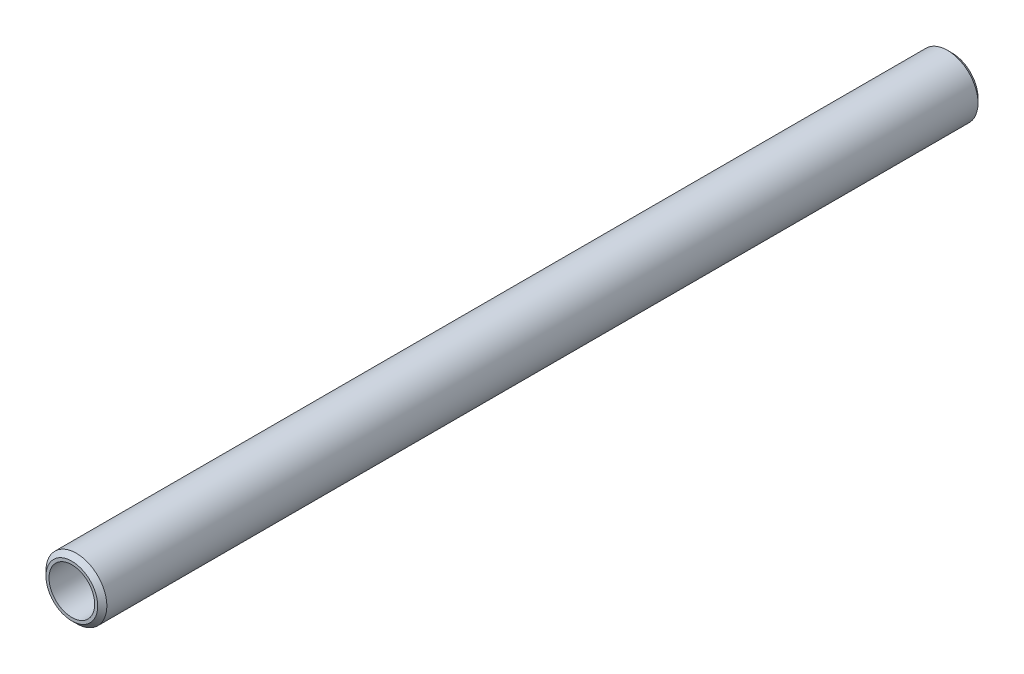
ISO-10303-21;
HEADER;
FILE_DESCRIPTION(('STEP AP214'),'2;1');
FILE_NAME('part.step','',(''),(''),'','','');
FILE_SCHEMA(('AUTOMOTIVE_DESIGN { 1 0 10303 214 1 1 1 1 }'));
ENDSEC;
DATA;
#1=APPLICATION_CONTEXT('core data for automotive mechanical design processes');
#2=APPLICATION_PROTOCOL_DEFINITION('international standard','automotive_design',2000,#1);
#3=PRODUCT_CONTEXT('',#1,'mechanical');
#4=PRODUCT('Part','Part','',(#3));
#5=PRODUCT_RELATED_PRODUCT_CATEGORY('part','',(#4));
#6=PRODUCT_DEFINITION_FORMATION('','',#4);
#7=PRODUCT_DEFINITION_CONTEXT('part definition',#1,'design');
#8=PRODUCT_DEFINITION('design','',#6,#7);
#9=PRODUCT_DEFINITION_SHAPE('','',#8);
#10=(LENGTH_UNIT() NAMED_UNIT(*) SI_UNIT(.MILLI.,.METRE.));
#11=(NAMED_UNIT(*) PLANE_ANGLE_UNIT() SI_UNIT($,.RADIAN.));
#12=(NAMED_UNIT(*) SI_UNIT($,.STERADIAN.) SOLID_ANGLE_UNIT());
#13=UNCERTAINTY_MEASURE_WITH_UNIT(LENGTH_MEASURE(1.E-05),#10,'distance_accuracy_value','');
#14=(GEOMETRIC_REPRESENTATION_CONTEXT(3) GLOBAL_UNCERTAINTY_ASSIGNED_CONTEXT((#13)) GLOBAL_UNIT_ASSIGNED_CONTEXT((#10,
#11,#12)) REPRESENTATION_CONTEXT('',''));
#15=CARTESIAN_POINT('',(0.,0.,0.));
#16=DIRECTION('',(0.,0.,1.));
#17=DIRECTION('',(1.,0.,0.));
#18=AXIS2_PLACEMENT_3D('',#15,#16,#17);
#19=CARTESIAN_POINT('',(0.,0.,-1042.));
#20=DIRECTION('',(0.,0.,1.));
#21=DIRECTION('',(1.,0.,0.));
#22=AXIS2_PLACEMENT_3D('',#19,#20,#21);
#23=PLANE('',#22);
#24=CARTESIAN_POINT('',(0.,0.,-1042.));
#25=DIRECTION('',(0.,0.,1.));
#26=DIRECTION('',(1.,0.,0.));
#27=AXIS2_PLACEMENT_3D('',#24,#25,#26);
#28=CIRCLE('',#27,17.);
#29=CARTESIAN_POINT('',(17.,0.,-1042.));
#30=VERTEX_POINT('',#29);
#31=EDGE_CURVE('E56',#30,#30,#28,.T.);
#32=ORIENTED_EDGE('',*,*,#31,.F.);
#33=EDGE_LOOP('',(#32));
#34=FACE_BOUND('',#33,.T.);
#35=CARTESIAN_POINT('',(0.,0.,-1042.));
#36=DIRECTION('',(0.,0.,1.));
#37=DIRECTION('',(1.,0.,0.));
#38=AXIS2_PLACEMENT_3D('',#35,#36,#37);
#39=CIRCLE('',#38,15.);
#40=CARTESIAN_POINT('',(15.,0.,-1042.));
#41=VERTEX_POINT('',#40);
#42=EDGE_CURVE('E68',#41,#41,#39,.T.);
#43=ORIENTED_EDGE('',*,*,#42,.T.);
#44=EDGE_LOOP('',(#43));
#45=FACE_BOUND('',#44,.T.);
#46=ADVANCED_FACE('F45',(#34,#45),#23,.F.);
#47=CARTESIAN_POINT('',(0.,0.,-1042.));
#48=DIRECTION('',(0.,0.,1.));
#49=DIRECTION('',(1.,0.,0.));
#50=AXIS2_PLACEMENT_3D('',#47,#48,#49);
#51=CONICAL_SURFACE('',#50,17.,0.785398163397466);
#52=CARTESIAN_POINT('',(0.,0.,-1039.));
#53=DIRECTION('',(0.,0.,1.));
#54=DIRECTION('',(1.,0.,0.));
#55=AXIS2_PLACEMENT_3D('',#52,#53,#54);
#56=CIRCLE('',#55,20.);
#57=CARTESIAN_POINT('',(20.,0.,-1039.));
#58=VERTEX_POINT('',#57);
#59=EDGE_CURVE('E60',#58,#58,#56,.T.);
#60=ORIENTED_EDGE('',*,*,#59,.F.);
#61=EDGE_LOOP('',(#60));
#62=FACE_BOUND('',#61,.T.);
#63=ORIENTED_EDGE('',*,*,#31,.T.);
#64=EDGE_LOOP('',(#63));
#65=FACE_BOUND('',#64,.T.);
#66=ADVANCED_FACE('F86',(#62,#65),#51,.T.);
#67=CARTESIAN_POINT('',(0.,0.,0.));
#68=DIRECTION('',(0.,0.,1.));
#69=DIRECTION('',(1.,0.,0.));
#70=AXIS2_PLACEMENT_3D('',#67,#68,#69);
#71=CYLINDRICAL_SURFACE('',#70,20.);
#72=CARTESIAN_POINT('',(0.,0.,-467.));
#73=DIRECTION('',(0.,0.,1.));
#74=DIRECTION('',(1.,0.,0.));
#75=AXIS2_PLACEMENT_3D('',#72,#73,#74);
#76=CIRCLE('',#75,20.);
#77=CARTESIAN_POINT('',(20.,0.,-467.));
#78=VERTEX_POINT('',#77);
#79=EDGE_CURVE('E12',#78,#78,#76,.F.);
#80=ORIENTED_EDGE('',*,*,#79,.T.);
#81=EDGE_LOOP('',(#80));
#82=FACE_BOUND('',#81,.T.);
#83=ORIENTED_EDGE('',*,*,#59,.T.);
#84=EDGE_LOOP('',(#83));
#85=FACE_BOUND('',#84,.T.);
#86=ADVANCED_FACE('F81',(#82,#85),#71,.T.);
#87=CARTESIAN_POINT('',(0.,0.,-464.));
#88=DIRECTION('',(0.,0.,1.));
#89=DIRECTION('',(1.,0.,0.));
#90=AXIS2_PLACEMENT_3D('',#87,#88,#89);
#91=PLANE('',#90);
#92=CARTESIAN_POINT('',(0.,0.,-464.));
#93=DIRECTION('',(0.,0.,1.));
#94=DIRECTION('',(1.,0.,0.));
#95=AXIS2_PLACEMENT_3D('',#92,#93,#94);
#96=CIRCLE('',#95,16.9999999999998);
#97=CARTESIAN_POINT('',(16.9999999999998,0.,-464.));
#98=VERTEX_POINT('',#97);
#99=EDGE_CURVE('E52',#98,#98,#96,.T.);
#100=ORIENTED_EDGE('',*,*,#99,.T.);
#101=EDGE_LOOP('',(#100));
#102=FACE_BOUND('',#101,.T.);
#103=CARTESIAN_POINT('',(0.,0.,-464.));
#104=DIRECTION('',(0.,0.,1.));
#105=DIRECTION('',(1.,0.,0.));
#106=AXIS2_PLACEMENT_3D('',#103,#104,#105);
#107=CIRCLE('',#106,15.);
#108=CARTESIAN_POINT('',(15.,0.,-464.));
#109=VERTEX_POINT('',#108);
#110=EDGE_CURVE('E65',#109,#109,#107,.T.);
#111=ORIENTED_EDGE('',*,*,#110,.F.);
#112=EDGE_LOOP('',(#111));
#113=FACE_BOUND('',#112,.T.);
#114=ADVANCED_FACE('F76',(#102,#113),#91,.T.);
#115=CARTESIAN_POINT('',(0.,0.,0.));
#116=DIRECTION('',(0.,0.,1.));
#117=DIRECTION('',(1.,0.,0.));
#118=AXIS2_PLACEMENT_3D('',#115,#116,#117);
#119=CYLINDRICAL_SURFACE('',#118,15.);
#120=ORIENTED_EDGE('',*,*,#42,.F.);
#121=EDGE_LOOP('',(#120));
#122=FACE_BOUND('',#121,.T.);
#123=ORIENTED_EDGE('',*,*,#110,.T.);
#124=EDGE_LOOP('',(#123));
#125=FACE_BOUND('',#124,.T.);
#126=ADVANCED_FACE('F73',(#122,#125),#119,.F.);
#127=CARTESIAN_POINT('',(0.,0.,-464.));
#128=DIRECTION('',(0.,0.,-1.));
#129=DIRECTION('',(-1.,0.,0.));
#130=AXIS2_PLACEMENT_3D('',#127,#128,#129);
#131=CONICAL_SURFACE('',#130,16.9999999999998,0.785398163397448);
#132=ORIENTED_EDGE('',*,*,#79,.F.);
#133=EDGE_LOOP('',(#132));
#134=FACE_BOUND('',#133,.T.);
#135=ORIENTED_EDGE('',*,*,#99,.F.);
#136=EDGE_LOOP('',(#135));
#137=FACE_BOUND('',#136,.T.);
#138=ADVANCED_FACE('F47',(#134,#137),#131,.T.);
#139=CLOSED_SHELL('',(#46,#66,#86,#114,#126,#138));
#140=MANIFOLD_SOLID_BREP('B2',#139);
#141=ADVANCED_BREP_SHAPE_REPRESENTATION('',(#18,#140),#14);
#142=SHAPE_DEFINITION_REPRESENTATION(#9,#141);
ENDSEC;
END-ISO-10303-21;
